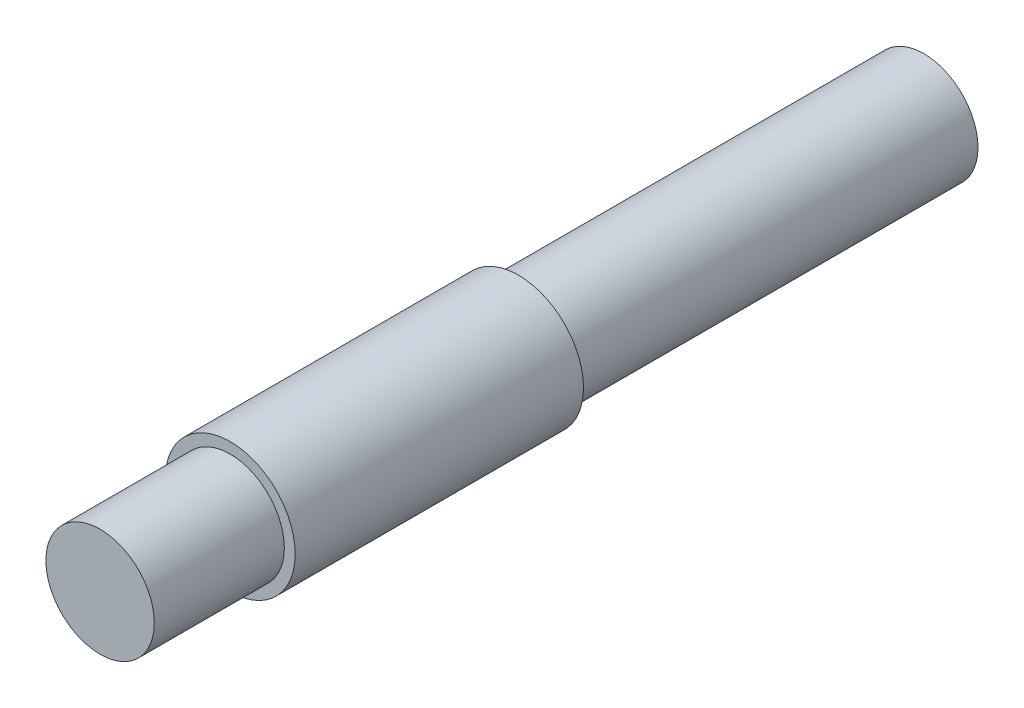
ISO-10303-21;
HEADER;
FILE_DESCRIPTION(('STEP AP214'),'2;1');
FILE_NAME('part.step','',(''),(''),'','','');
FILE_SCHEMA(('AUTOMOTIVE_DESIGN { 1 0 10303 214 1 1 1 1 }'));
ENDSEC;
DATA;
#1=APPLICATION_CONTEXT('core data for automotive mechanical design processes');
#2=APPLICATION_PROTOCOL_DEFINITION('international standard','automotive_design',2000,#1);
#3=PRODUCT_CONTEXT('',#1,'mechanical');
#4=PRODUCT('Part','Part','',(#3));
#5=PRODUCT_RELATED_PRODUCT_CATEGORY('part','',(#4));
#6=PRODUCT_DEFINITION_FORMATION('','',#4);
#7=PRODUCT_DEFINITION_CONTEXT('part definition',#1,'design');
#8=PRODUCT_DEFINITION('design','',#6,#7);
#9=PRODUCT_DEFINITION_SHAPE('','',#8);
#10=(LENGTH_UNIT() NAMED_UNIT(*) SI_UNIT(.MILLI.,.METRE.));
#11=(NAMED_UNIT(*) PLANE_ANGLE_UNIT() SI_UNIT($,.RADIAN.));
#12=(NAMED_UNIT(*) SI_UNIT($,.STERADIAN.) SOLID_ANGLE_UNIT());
#13=UNCERTAINTY_MEASURE_WITH_UNIT(LENGTH_MEASURE(1.E-05),#10,'distance_accuracy_value','');
#14=(GEOMETRIC_REPRESENTATION_CONTEXT(3) GLOBAL_UNCERTAINTY_ASSIGNED_CONTEXT((#13)) GLOBAL_UNIT_ASSIGNED_CONTEXT((#10,
#11,#12)) REPRESENTATION_CONTEXT('',''));
#15=CARTESIAN_POINT('',(0.,0.,0.));
#16=DIRECTION('',(0.,0.,1.));
#17=DIRECTION('',(1.,0.,0.));
#18=AXIS2_PLACEMENT_3D('',#15,#16,#17);
#19=CARTESIAN_POINT('',(0.,0.,18.7));
#20=DIRECTION('',(0.,0.,-1.));
#21=DIRECTION('',(-1.,0.,0.));
#22=AXIS2_PLACEMENT_3D('',#19,#20,#21);
#23=CYLINDRICAL_SURFACE('',#22,2.5);
#24=CARTESIAN_POINT('',(0.,0.,18.7));
#25=DIRECTION('',(0.,0.,1.));
#26=DIRECTION('',(1.,0.,0.));
#27=AXIS2_PLACEMENT_3D('',#24,#25,#26);
#28=CIRCLE('',#27,2.5);
#29=CARTESIAN_POINT('',(2.5,0.,18.7));
#30=VERTEX_POINT('',#29);
#31=EDGE_CURVE('E45',#30,#30,#28,.T.);
#32=ORIENTED_EDGE('',*,*,#31,.F.);
#33=EDGE_LOOP('',(#32));
#34=FACE_BOUND('',#33,.T.);
#35=CARTESIAN_POINT('',(0.,0.,0.));
#36=DIRECTION('',(0.,0.,1.));
#37=DIRECTION('',(1.,0.,0.));
#38=AXIS2_PLACEMENT_3D('',#35,#36,#37);
#39=CIRCLE('',#38,2.5);
#40=CARTESIAN_POINT('',(2.5,0.,0.));
#41=VERTEX_POINT('',#40);
#42=EDGE_CURVE('E40',#41,#41,#39,.T.);
#43=ORIENTED_EDGE('',*,*,#42,.T.);
#44=EDGE_LOOP('',(#43));
#45=FACE_BOUND('',#44,.T.);
#46=ADVANCED_FACE('F37',(#34,#45),#23,.T.);
#47=CARTESIAN_POINT('',(0.,0.,0.));
#48=DIRECTION('',(0.,0.,1.));
#49=DIRECTION('',(1.,0.,0.));
#50=AXIS2_PLACEMENT_3D('',#47,#48,#49);
#51=PLANE('',#50);
#52=ORIENTED_EDGE('',*,*,#42,.F.);
#53=EDGE_LOOP('',(#52));
#54=FACE_BOUND('',#53,.T.);
#55=ADVANCED_FACE('F83',(#54),#51,.F.);
#56=CARTESIAN_POINT('',(0.,0.,32.));
#57=DIRECTION('',(0.,0.,-1.));
#58=DIRECTION('',(-1.,0.,0.));
#59=AXIS2_PLACEMENT_3D('',#56,#57,#58);
#60=CYLINDRICAL_SURFACE('',#59,3.);
#61=CARTESIAN_POINT('',(0.,0.,32.));
#62=DIRECTION('',(0.,0.,1.));
#63=DIRECTION('',(1.,0.,0.));
#64=AXIS2_PLACEMENT_3D('',#61,#62,#63);
#65=CIRCLE('',#64,3.);
#66=CARTESIAN_POINT('',(3.,0.,32.));
#67=VERTEX_POINT('',#66);
#68=EDGE_CURVE('E54',#67,#67,#65,.T.);
#69=ORIENTED_EDGE('',*,*,#68,.F.);
#70=EDGE_LOOP('',(#69));
#71=FACE_BOUND('',#70,.T.);
#72=CARTESIAN_POINT('',(0.,0.,18.7));
#73=DIRECTION('',(0.,0.,1.));
#74=DIRECTION('',(1.,0.,0.));
#75=AXIS2_PLACEMENT_3D('',#72,#73,#74);
#76=CIRCLE('',#75,3.);
#77=CARTESIAN_POINT('',(3.,0.,18.7));
#78=VERTEX_POINT('',#77);
#79=EDGE_CURVE('E58',#78,#78,#76,.T.);
#80=ORIENTED_EDGE('',*,*,#79,.T.);
#81=EDGE_LOOP('',(#80));
#82=FACE_BOUND('',#81,.T.);
#83=ADVANCED_FACE('F88',(#71,#82),#60,.T.);
#84=CARTESIAN_POINT('',(0.,0.,32.));
#85=DIRECTION('',(0.,0.,1.));
#86=DIRECTION('',(1.,0.,0.));
#87=AXIS2_PLACEMENT_3D('',#84,#85,#86);
#88=PLANE('',#87);
#89=CARTESIAN_POINT('',(0.,0.,32.));
#90=DIRECTION('',(0.,0.,1.));
#91=DIRECTION('',(1.,0.,0.));
#92=AXIS2_PLACEMENT_3D('',#89,#90,#91);
#93=CIRCLE('',#92,2.5);
#94=CARTESIAN_POINT('',(2.5,0.,32.));
#95=VERTEX_POINT('',#94);
#96=EDGE_CURVE('E10',#95,#95,#93,.T.);
#97=ORIENTED_EDGE('',*,*,#96,.F.);
#98=EDGE_LOOP('',(#97));
#99=FACE_BOUND('',#98,.T.);
#100=ORIENTED_EDGE('',*,*,#68,.T.);
#101=EDGE_LOOP('',(#100));
#102=FACE_BOUND('',#101,.T.);
#103=ADVANCED_FACE('F78',(#99,#102),#88,.T.);
#104=CARTESIAN_POINT('',(0.,0.,18.7));
#105=DIRECTION('',(0.,0.,1.));
#106=DIRECTION('',(1.,0.,0.));
#107=AXIS2_PLACEMENT_3D('',#104,#105,#106);
#108=PLANE('',#107);
#109=ORIENTED_EDGE('',*,*,#31,.T.);
#110=EDGE_LOOP('',(#109));
#111=FACE_BOUND('',#110,.T.);
#112=ORIENTED_EDGE('',*,*,#79,.F.);
#113=EDGE_LOOP('',(#112));
#114=FACE_BOUND('',#113,.T.);
#115=ADVANCED_FACE('F71',(#111,#114),#108,.F.);
#116=CARTESIAN_POINT('',(0.,0.,38.));
#117=DIRECTION('',(0.,0.,-1.));
#118=DIRECTION('',(-1.,0.,0.));
#119=AXIS2_PLACEMENT_3D('',#116,#117,#118);
#120=CYLINDRICAL_SURFACE('',#119,2.5);
#121=CARTESIAN_POINT('',(0.,0.,38.));
#122=DIRECTION('',(0.,0.,1.));
#123=DIRECTION('',(1.,0.,0.));
#124=AXIS2_PLACEMENT_3D('',#121,#122,#123);
#125=CIRCLE('',#124,2.5);
#126=CARTESIAN_POINT('',(2.5,0.,38.));
#127=VERTEX_POINT('',#126);
#128=EDGE_CURVE('E53',#127,#127,#125,.T.);
#129=ORIENTED_EDGE('',*,*,#128,.F.);
#130=EDGE_LOOP('',(#129));
#131=FACE_BOUND('',#130,.T.);
#132=ORIENTED_EDGE('',*,*,#96,.T.);
#133=EDGE_LOOP('',(#132));
#134=FACE_BOUND('',#133,.T.);
#135=ADVANCED_FACE('F69',(#131,#134),#120,.T.);
#136=CARTESIAN_POINT('',(0.,0.,38.));
#137=DIRECTION('',(0.,0.,1.));
#138=DIRECTION('',(1.,0.,0.));
#139=AXIS2_PLACEMENT_3D('',#136,#137,#138);
#140=PLANE('',#139);
#141=ORIENTED_EDGE('',*,*,#128,.T.);
#142=EDGE_LOOP('',(#141));
#143=FACE_BOUND('',#142,.T.);
#144=ADVANCED_FACE('F67',(#143),#140,.T.);
#145=CLOSED_SHELL('',(#46,#55,#83,#103,#115,#135,#144));
#146=MANIFOLD_SOLID_BREP('B2',#145);
#147=ADVANCED_BREP_SHAPE_REPRESENTATION('',(#18,#146),#14);
#148=SHAPE_DEFINITION_REPRESENTATION(#9,#147);
ENDSEC;
END-ISO-10303-21;
